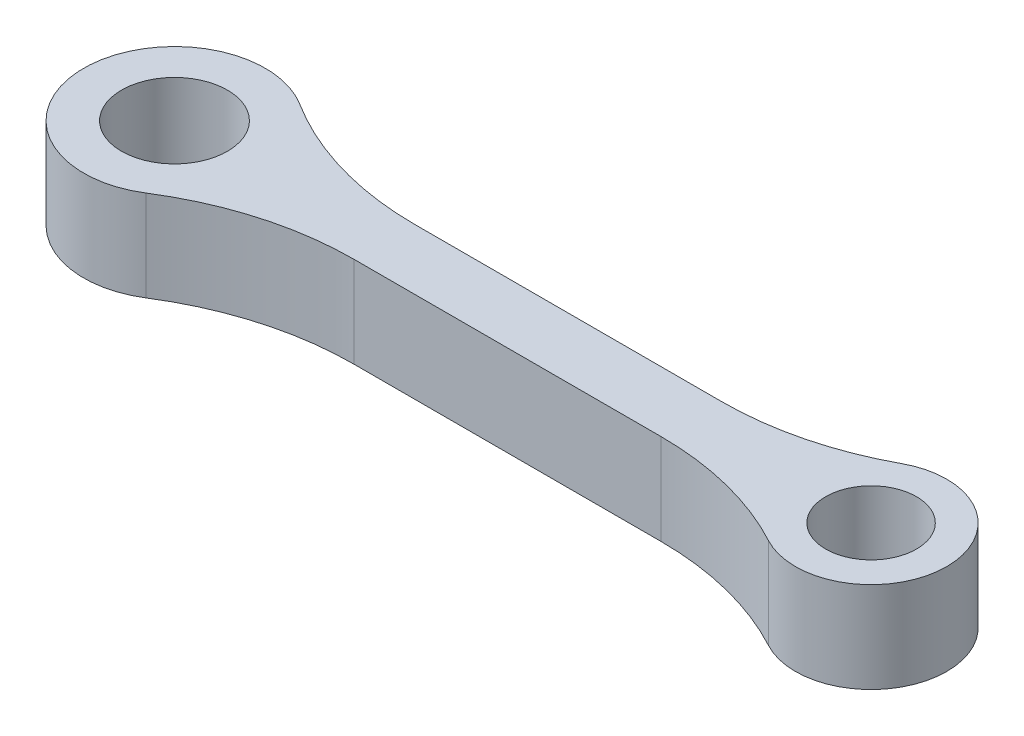
ISO-10303-21;
HEADER;
FILE_DESCRIPTION(('STEP AP214'),'2;1');
FILE_NAME('part.step','',(''),(''),'','','');
FILE_SCHEMA(('AUTOMOTIVE_DESIGN { 1 0 10303 214 1 1 1 1 }'));
ENDSEC;
DATA;
#1=APPLICATION_CONTEXT('core data for automotive mechanical design processes');
#2=APPLICATION_PROTOCOL_DEFINITION('international standard','automotive_design',2000,#1);
#3=PRODUCT_CONTEXT('',#1,'mechanical');
#4=PRODUCT('Part','Part','',(#3));
#5=PRODUCT_RELATED_PRODUCT_CATEGORY('part','',(#4));
#6=PRODUCT_DEFINITION_FORMATION('','',#4);
#7=PRODUCT_DEFINITION_CONTEXT('part definition',#1,'design');
#8=PRODUCT_DEFINITION('design','',#6,#7);
#9=PRODUCT_DEFINITION_SHAPE('','',#8);
#10=(LENGTH_UNIT() NAMED_UNIT(*) SI_UNIT(.MILLI.,.METRE.));
#11=(NAMED_UNIT(*) PLANE_ANGLE_UNIT() SI_UNIT($,.RADIAN.));
#12=(NAMED_UNIT(*) SI_UNIT($,.STERADIAN.) SOLID_ANGLE_UNIT());
#13=UNCERTAINTY_MEASURE_WITH_UNIT(LENGTH_MEASURE(1.E-05),#10,'distance_accuracy_value','');
#14=(GEOMETRIC_REPRESENTATION_CONTEXT(3) GLOBAL_UNCERTAINTY_ASSIGNED_CONTEXT((#13)) GLOBAL_UNIT_ASSIGNED_CONTEXT((#10,
#11,#12)) REPRESENTATION_CONTEXT('',''));
#15=CARTESIAN_POINT('',(0.,0.,0.));
#16=DIRECTION('',(0.,0.,1.));
#17=DIRECTION('',(1.,0.,0.));
#18=AXIS2_PLACEMENT_3D('',#15,#16,#17);
#19=CARTESIAN_POINT('',(6.92820323027551,3.,11.));
#20=DIRECTION('',(0.,1.,0.));
#21=DIRECTION('',(0.,0.,1.));
#22=AXIS2_PLACEMENT_3D('',#19,#20,#21);
#23=PLANE('',#22);
#24=CARTESIAN_POINT('',(0.,3.,0.));
#25=DIRECTION('',(0.,1.,0.));
#26=DIRECTION('',(0.,0.,1.));
#27=AXIS2_PLACEMENT_3D('',#24,#25,#26);
#28=CIRCLE('',#27,1.75);
#29=CARTESIAN_POINT('',(0.,3.,1.75));
#30=VERTEX_POINT('',#29);
#31=EDGE_CURVE('E146',#30,#30,#28,.T.);
#32=ORIENTED_EDGE('',*,*,#31,.F.);
#33=EDGE_LOOP('',(#32));
#34=FACE_BOUND('',#33,.T.);
#35=CARTESIAN_POINT('',(6.92820323027551,3.,11.));
#36=DIRECTION('',(0.,-1.,0.));
#37=DIRECTION('',(0.,0.,1.));
#38=AXIS2_PLACEMENT_3D('',#35,#36,#37);
#39=CIRCLE('',#38,10.);
#40=CARTESIAN_POINT('',(1.59881613006358,3.,2.53846153846154));
#41=VERTEX_POINT('',#40);
#42=CARTESIAN_POINT('',(6.92820323027551,3.,0.999999999999999));
#43=VERTEX_POINT('',#42);
#44=EDGE_CURVE('E164',#41,#43,#39,.T.);
#45=ORIENTED_EDGE('',*,*,#44,.T.);
#46=DIRECTION('',(1.,0.,0.));
#47=VECTOR('',#46,1.);
#48=CARTESIAN_POINT('',(6.92820323027551,3.,0.999999999999999));
#49=LINE('',#48,#47);
#50=CARTESIAN_POINT('',(17.062828956481,3.,1.));
#51=VERTEX_POINT('',#50);
#52=EDGE_CURVE('E100',#43,#51,#49,.T.);
#53=ORIENTED_EDGE('',*,*,#52,.T.);
#54=CARTESIAN_POINT('',(17.062828956481,3.,11.));
#55=DIRECTION('',(0.,-1.,0.));
#56=DIRECTION('',(0.,0.,-1.));
#57=AXIS2_PLACEMENT_3D('',#54,#55,#56);
#58=CIRCLE('',#57,10.);
#59=CARTESIAN_POINT('',(21.8125657912962,3.,2.2));
#60=VERTEX_POINT('',#59);
#61=EDGE_CURVE('E185',#51,#60,#58,.T.);
#62=ORIENTED_EDGE('',*,*,#61,.T.);
#63=CARTESIAN_POINT('',(23.,3.,0.));
#64=DIRECTION('',(0.,1.,0.));
#65=DIRECTION('',(0.,0.,1.));
#66=AXIS2_PLACEMENT_3D('',#63,#64,#65);
#67=CIRCLE('',#66,2.5);
#68=CARTESIAN_POINT('',(21.8125657912962,3.,-2.2));
#69=VERTEX_POINT('',#68);
#70=EDGE_CURVE('E199',#60,#69,#67,.T.);
#71=ORIENTED_EDGE('',*,*,#70,.T.);
#72=CARTESIAN_POINT('',(17.062828956481,3.,-11.));
#73=DIRECTION('',(0.,-1.,0.));
#74=DIRECTION('',(0.,0.,1.));
#75=AXIS2_PLACEMENT_3D('',#72,#73,#74);
#76=CIRCLE('',#75,10.);
#77=CARTESIAN_POINT('',(17.062828956481,3.,-1.));
#78=VERTEX_POINT('',#77);
#79=EDGE_CURVE('E119',#69,#78,#76,.T.);
#80=ORIENTED_EDGE('',*,*,#79,.T.);
#81=DIRECTION('',(-1.,0.,0.));
#82=VECTOR('',#81,1.);
#83=CARTESIAN_POINT('',(6.92820323027551,3.,-0.999999999999999));
#84=LINE('',#83,#82);
#85=CARTESIAN_POINT('',(6.92820323027551,3.,-0.999999999999999));
#86=VERTEX_POINT('',#85);
#87=EDGE_CURVE('E113',#78,#86,#84,.T.);
#88=ORIENTED_EDGE('',*,*,#87,.T.);
#89=CARTESIAN_POINT('',(6.92820323027551,3.,-11.));
#90=DIRECTION('',(0.,-1.,0.));
#91=DIRECTION('',(0.,0.,-1.));
#92=AXIS2_PLACEMENT_3D('',#89,#90,#91);
#93=CIRCLE('',#92,10.);
#94=CARTESIAN_POINT('',(1.59881613006358,3.,-2.53846153846154));
#95=VERTEX_POINT('',#94);
#96=EDGE_CURVE('E117',#86,#95,#93,.T.);
#97=ORIENTED_EDGE('',*,*,#96,.T.);
#98=CARTESIAN_POINT('',(0.,3.,0.));
#99=DIRECTION('',(0.,1.,0.));
#100=DIRECTION('',(0.,0.,1.));
#101=AXIS2_PLACEMENT_3D('',#98,#99,#100);
#102=CIRCLE('',#101,3.);
#103=EDGE_CURVE('E57',#95,#41,#102,.T.);
#104=ORIENTED_EDGE('',*,*,#103,.T.);
#105=EDGE_LOOP('',(#45,#53,#62,#71,#80,#88,#97,#104));
#106=FACE_BOUND('',#105,.T.);
#107=CARTESIAN_POINT('',(23.,3.,0.));
#108=DIRECTION('',(0.,1.,0.));
#109=DIRECTION('',(0.,0.,1.));
#110=AXIS2_PLACEMENT_3D('',#107,#108,#109);
#111=CIRCLE('',#110,1.5);
#112=CARTESIAN_POINT('',(23.,3.,1.5));
#113=VERTEX_POINT('',#112);
#114=EDGE_CURVE('E213',#113,#113,#111,.T.);
#115=ORIENTED_EDGE('',*,*,#114,.F.);
#116=EDGE_LOOP('',(#115));
#117=FACE_BOUND('',#116,.T.);
#118=ADVANCED_FACE('F39',(#34,#106,#117),#23,.T.);
#119=CARTESIAN_POINT('',(6.92820323027551,0.,11.));
#120=DIRECTION('',(0.,1.,0.));
#121=DIRECTION('',(0.,0.,1.));
#122=AXIS2_PLACEMENT_3D('',#119,#120,#121);
#123=PLANE('',#122);
#124=CARTESIAN_POINT('',(6.92820323027551,0.,11.));
#125=DIRECTION('',(0.,-1.,0.));
#126=DIRECTION('',(0.,0.,1.));
#127=AXIS2_PLACEMENT_3D('',#124,#125,#126);
#128=CIRCLE('',#127,10.);
#129=CARTESIAN_POINT('',(1.59881613006358,0.,2.53846153846154));
#130=VERTEX_POINT('',#129);
#131=CARTESIAN_POINT('',(6.92820323027551,0.,0.999999999999999));
#132=VERTEX_POINT('',#131);
#133=EDGE_CURVE('E141',#130,#132,#128,.T.);
#134=ORIENTED_EDGE('',*,*,#133,.F.);
#135=CARTESIAN_POINT('',(0.,0.,0.));
#136=DIRECTION('',(0.,1.,0.));
#137=DIRECTION('',(0.,0.,1.));
#138=AXIS2_PLACEMENT_3D('',#135,#136,#137);
#139=CIRCLE('',#138,3.);
#140=CARTESIAN_POINT('',(1.59881613006358,0.,-2.53846153846154));
#141=VERTEX_POINT('',#140);
#142=EDGE_CURVE('E92',#141,#130,#139,.T.);
#143=ORIENTED_EDGE('',*,*,#142,.F.);
#144=CARTESIAN_POINT('',(6.92820323027551,0.,-11.));
#145=DIRECTION('',(0.,-1.,0.));
#146=DIRECTION('',(0.,0.,-1.));
#147=AXIS2_PLACEMENT_3D('',#144,#145,#146);
#148=CIRCLE('',#147,10.);
#149=CARTESIAN_POINT('',(6.92820323027551,0.,-0.999999999999999));
#150=VERTEX_POINT('',#149);
#151=EDGE_CURVE('E86',#150,#141,#148,.T.);
#152=ORIENTED_EDGE('',*,*,#151,.F.);
#153=DIRECTION('',(-1.,0.,0.));
#154=VECTOR('',#153,1.);
#155=CARTESIAN_POINT('',(6.92820323027551,0.,-0.999999999999999));
#156=LINE('',#155,#154);
#157=CARTESIAN_POINT('',(17.062828956481,0.,-1.));
#158=VERTEX_POINT('',#157);
#159=EDGE_CURVE('E128',#158,#150,#156,.T.);
#160=ORIENTED_EDGE('',*,*,#159,.F.);
#161=CARTESIAN_POINT('',(17.062828956481,0.,-11.));
#162=DIRECTION('',(0.,-1.,0.));
#163=DIRECTION('',(0.,0.,1.));
#164=AXIS2_PLACEMENT_3D('',#161,#162,#163);
#165=CIRCLE('',#164,10.);
#166=CARTESIAN_POINT('',(21.8125657912962,0.,-2.2));
#167=VERTEX_POINT('',#166);
#168=EDGE_CURVE('E155',#167,#158,#165,.T.);
#169=ORIENTED_EDGE('',*,*,#168,.F.);
#170=CARTESIAN_POINT('',(23.,0.,0.));
#171=DIRECTION('',(0.,1.,0.));
#172=DIRECTION('',(0.,0.,1.));
#173=AXIS2_PLACEMENT_3D('',#170,#171,#172);
#174=CIRCLE('',#173,2.5);
#175=CARTESIAN_POINT('',(21.8125657912962,0.,2.2));
#176=VERTEX_POINT('',#175);
#177=EDGE_CURVE('E152',#176,#167,#174,.T.);
#178=ORIENTED_EDGE('',*,*,#177,.F.);
#179=CARTESIAN_POINT('',(17.062828956481,0.,11.));
#180=DIRECTION('',(0.,-1.,0.));
#181=DIRECTION('',(0.,0.,-1.));
#182=AXIS2_PLACEMENT_3D('',#179,#180,#181);
#183=CIRCLE('',#182,10.);
#184=CARTESIAN_POINT('',(17.062828956481,0.,1.));
#185=VERTEX_POINT('',#184);
#186=EDGE_CURVE('E149',#185,#176,#183,.T.);
#187=ORIENTED_EDGE('',*,*,#186,.F.);
#188=DIRECTION('',(1.,0.,0.));
#189=VECTOR('',#188,1.);
#190=CARTESIAN_POINT('',(6.92820323027551,0.,0.999999999999999));
#191=LINE('',#190,#189);
#192=EDGE_CURVE('E145',#132,#185,#191,.T.);
#193=ORIENTED_EDGE('',*,*,#192,.F.);
#194=EDGE_LOOP('',(#134,#143,#152,#160,#169,#178,#187,#193));
#195=FACE_BOUND('',#194,.T.);
#196=CARTESIAN_POINT('',(0.,0.,0.));
#197=DIRECTION('',(0.,1.,0.));
#198=DIRECTION('',(0.,0.,1.));
#199=AXIS2_PLACEMENT_3D('',#196,#197,#198);
#200=CIRCLE('',#199,1.75);
#201=CARTESIAN_POINT('',(0.,0.,1.75));
#202=VERTEX_POINT('',#201);
#203=EDGE_CURVE('E209',#202,#202,#200,.T.);
#204=ORIENTED_EDGE('',*,*,#203,.T.);
#205=EDGE_LOOP('',(#204));
#206=FACE_BOUND('',#205,.T.);
#207=CARTESIAN_POINT('',(23.,0.,0.));
#208=DIRECTION('',(0.,1.,0.));
#209=DIRECTION('',(0.,0.,1.));
#210=AXIS2_PLACEMENT_3D('',#207,#208,#209);
#211=CIRCLE('',#210,1.5);
#212=CARTESIAN_POINT('',(23.,0.,1.5));
#213=VERTEX_POINT('',#212);
#214=EDGE_CURVE('E217',#213,#213,#211,.T.);
#215=ORIENTED_EDGE('',*,*,#214,.T.);
#216=EDGE_LOOP('',(#215));
#217=FACE_BOUND('',#216,.T.);
#218=ADVANCED_FACE('F189',(#195,#206,#217),#123,.F.);
#219=CARTESIAN_POINT('',(6.92820323027551,3.,11.));
#220=DIRECTION('',(0.,-1.,0.));
#221=DIRECTION('',(0.,0.,-1.));
#222=AXIS2_PLACEMENT_3D('',#219,#220,#221);
#223=CYLINDRICAL_SURFACE('',#222,10.);
#224=ORIENTED_EDGE('',*,*,#133,.T.);
#225=DIRECTION('',(0.,-1.,0.));
#226=VECTOR('',#225,1.);
#227=CARTESIAN_POINT('',(6.92820323027551,3.,0.999999999999999));
#228=LINE('',#227,#226);
#229=EDGE_CURVE('E11',#43,#132,#228,.T.);
#230=ORIENTED_EDGE('',*,*,#229,.F.);
#231=ORIENTED_EDGE('',*,*,#44,.F.);
#232=DIRECTION('',(0.,-1.,0.));
#233=VECTOR('',#232,1.);
#234=CARTESIAN_POINT('',(1.59881613006358,3.,2.53846153846154));
#235=LINE('',#234,#233);
#236=EDGE_CURVE('E137',#41,#130,#235,.T.);
#237=ORIENTED_EDGE('',*,*,#236,.T.);
#238=EDGE_LOOP('',(#224,#230,#231,#237));
#239=FACE_BOUND('',#238,.T.);
#240=ADVANCED_FACE('F41',(#239),#223,.F.);
#241=CARTESIAN_POINT('',(6.92820323027551,3.,0.999999999999999));
#242=DIRECTION('',(0.,0.,-1.));
#243=DIRECTION('',(-1.,0.,0.));
#244=AXIS2_PLACEMENT_3D('',#241,#242,#243);
#245=PLANE('',#244);
#246=ORIENTED_EDGE('',*,*,#192,.T.);
#247=DIRECTION('',(0.,-1.,0.));
#248=VECTOR('',#247,1.);
#249=CARTESIAN_POINT('',(17.062828956481,3.,1.));
#250=LINE('',#249,#248);
#251=EDGE_CURVE('E49',#51,#185,#250,.T.);
#252=ORIENTED_EDGE('',*,*,#251,.F.);
#253=ORIENTED_EDGE('',*,*,#52,.F.);
#254=ORIENTED_EDGE('',*,*,#229,.T.);
#255=EDGE_LOOP('',(#246,#252,#253,#254));
#256=FACE_BOUND('',#255,.T.);
#257=ADVANCED_FACE('F251',(#256),#245,.F.);
#258=CARTESIAN_POINT('',(17.062828956481,3.,11.));
#259=DIRECTION('',(0.,-1.,0.));
#260=DIRECTION('',(0.,0.,-1.));
#261=AXIS2_PLACEMENT_3D('',#258,#259,#260);
#262=CYLINDRICAL_SURFACE('',#261,10.);
#263=ORIENTED_EDGE('',*,*,#186,.T.);
#264=DIRECTION('',(0.,-1.,0.));
#265=VECTOR('',#264,1.);
#266=CARTESIAN_POINT('',(21.8125657912962,3.,2.2));
#267=LINE('',#266,#265);
#268=EDGE_CURVE('E175',#60,#176,#267,.T.);
#269=ORIENTED_EDGE('',*,*,#268,.F.);
#270=ORIENTED_EDGE('',*,*,#61,.F.);
#271=ORIENTED_EDGE('',*,*,#251,.T.);
#272=EDGE_LOOP('',(#263,#269,#270,#271));
#273=FACE_BOUND('',#272,.T.);
#274=ADVANCED_FACE('F183',(#273),#262,.F.);
#275=CARTESIAN_POINT('',(23.,3.,0.));
#276=DIRECTION('',(0.,-1.,0.));
#277=DIRECTION('',(0.,0.,-1.));
#278=AXIS2_PLACEMENT_3D('',#275,#276,#277);
#279=CYLINDRICAL_SURFACE('',#278,2.5);
#280=ORIENTED_EDGE('',*,*,#177,.T.);
#281=DIRECTION('',(0.,-1.,0.));
#282=VECTOR('',#281,1.);
#283=CARTESIAN_POINT('',(21.8125657912962,3.,-2.2));
#284=LINE('',#283,#282);
#285=EDGE_CURVE('E171',#69,#167,#284,.T.);
#286=ORIENTED_EDGE('',*,*,#285,.F.);
#287=ORIENTED_EDGE('',*,*,#70,.F.);
#288=ORIENTED_EDGE('',*,*,#268,.T.);
#289=EDGE_LOOP('',(#280,#286,#287,#288));
#290=FACE_BOUND('',#289,.T.);
#291=ADVANCED_FACE('F194',(#290),#279,.T.);
#292=CARTESIAN_POINT('',(17.062828956481,3.,-11.));
#293=DIRECTION('',(0.,-1.,0.));
#294=DIRECTION('',(0.,0.,-1.));
#295=AXIS2_PLACEMENT_3D('',#292,#293,#294);
#296=CYLINDRICAL_SURFACE('',#295,10.);
#297=ORIENTED_EDGE('',*,*,#168,.T.);
#298=DIRECTION('',(0.,-1.,0.));
#299=VECTOR('',#298,1.);
#300=CARTESIAN_POINT('',(17.062828956481,3.,-1.));
#301=LINE('',#300,#299);
#302=EDGE_CURVE('E130',#78,#158,#301,.T.);
#303=ORIENTED_EDGE('',*,*,#302,.F.);
#304=ORIENTED_EDGE('',*,*,#79,.F.);
#305=ORIENTED_EDGE('',*,*,#285,.T.);
#306=EDGE_LOOP('',(#297,#303,#304,#305));
#307=FACE_BOUND('',#306,.T.);
#308=ADVANCED_FACE('F197',(#307),#296,.F.);
#309=CARTESIAN_POINT('',(6.92820323027551,3.,-0.999999999999999));
#310=DIRECTION('',(0.,0.,1.));
#311=DIRECTION('',(1.,0.,0.));
#312=AXIS2_PLACEMENT_3D('',#309,#310,#311);
#313=PLANE('',#312);
#314=ORIENTED_EDGE('',*,*,#159,.T.);
#315=DIRECTION('',(0.,-1.,0.));
#316=VECTOR('',#315,1.);
#317=CARTESIAN_POINT('',(6.92820323027551,3.,-0.999999999999999));
#318=LINE('',#317,#316);
#319=EDGE_CURVE('E125',#86,#150,#318,.T.);
#320=ORIENTED_EDGE('',*,*,#319,.F.);
#321=ORIENTED_EDGE('',*,*,#87,.F.);
#322=ORIENTED_EDGE('',*,*,#302,.T.);
#323=EDGE_LOOP('',(#314,#320,#321,#322));
#324=FACE_BOUND('',#323,.T.);
#325=ADVANCED_FACE('F126',(#324),#313,.F.);
#326=CARTESIAN_POINT('',(6.92820323027551,3.,-11.));
#327=DIRECTION('',(0.,-1.,0.));
#328=DIRECTION('',(0.,0.,-1.));
#329=AXIS2_PLACEMENT_3D('',#326,#327,#328);
#330=CYLINDRICAL_SURFACE('',#329,10.);
#331=ORIENTED_EDGE('',*,*,#151,.T.);
#332=DIRECTION('',(0.,-1.,0.));
#333=VECTOR('',#332,1.);
#334=CARTESIAN_POINT('',(1.59881613006358,3.,-2.53846153846154));
#335=LINE('',#334,#333);
#336=EDGE_CURVE('E131',#95,#141,#335,.T.);
#337=ORIENTED_EDGE('',*,*,#336,.F.);
#338=ORIENTED_EDGE('',*,*,#96,.F.);
#339=ORIENTED_EDGE('',*,*,#319,.T.);
#340=EDGE_LOOP('',(#331,#337,#338,#339));
#341=FACE_BOUND('',#340,.T.);
#342=ADVANCED_FACE('F133',(#341),#330,.F.);
#343=CARTESIAN_POINT('',(0.,3.,0.));
#344=DIRECTION('',(0.,-1.,0.));
#345=DIRECTION('',(0.,0.,-1.));
#346=AXIS2_PLACEMENT_3D('',#343,#344,#345);
#347=CYLINDRICAL_SURFACE('',#346,3.);
#348=ORIENTED_EDGE('',*,*,#142,.T.);
#349=ORIENTED_EDGE('',*,*,#236,.F.);
#350=ORIENTED_EDGE('',*,*,#103,.F.);
#351=ORIENTED_EDGE('',*,*,#336,.T.);
#352=EDGE_LOOP('',(#348,#349,#350,#351));
#353=FACE_BOUND('',#352,.T.);
#354=ADVANCED_FACE('F239',(#353),#347,.T.);
#355=CARTESIAN_POINT('',(0.,3.,0.));
#356=DIRECTION('',(0.,-1.,0.));
#357=DIRECTION('',(0.,0.,-1.));
#358=AXIS2_PLACEMENT_3D('',#355,#356,#357);
#359=CYLINDRICAL_SURFACE('',#358,1.75);
#360=ORIENTED_EDGE('',*,*,#31,.T.);
#361=EDGE_LOOP('',(#360));
#362=FACE_BOUND('',#361,.T.);
#363=ORIENTED_EDGE('',*,*,#203,.F.);
#364=EDGE_LOOP('',(#363));
#365=FACE_BOUND('',#364,.T.);
#366=ADVANCED_FACE('F236',(#362,#365),#359,.F.);
#367=CARTESIAN_POINT('',(23.,3.,0.));
#368=DIRECTION('',(0.,-1.,0.));
#369=DIRECTION('',(0.,0.,-1.));
#370=AXIS2_PLACEMENT_3D('',#367,#368,#369);
#371=CYLINDRICAL_SURFACE('',#370,1.5);
#372=ORIENTED_EDGE('',*,*,#114,.T.);
#373=EDGE_LOOP('',(#372));
#374=FACE_BOUND('',#373,.T.);
#375=ORIENTED_EDGE('',*,*,#214,.F.);
#376=EDGE_LOOP('',(#375));
#377=FACE_BOUND('',#376,.T.);
#378=ADVANCED_FACE('F225',(#374,#377),#371,.F.);
#379=CLOSED_SHELL('',(#118,#218,#240,#257,#274,#291,#308,#325,#342,#354,#366,#378));
#380=MANIFOLD_SOLID_BREP('B2',#379);
#381=ADVANCED_BREP_SHAPE_REPRESENTATION('',(#18,#380),#14);
#382=SHAPE_DEFINITION_REPRESENTATION(#9,#381);
ENDSEC;
END-ISO-10303-21;
